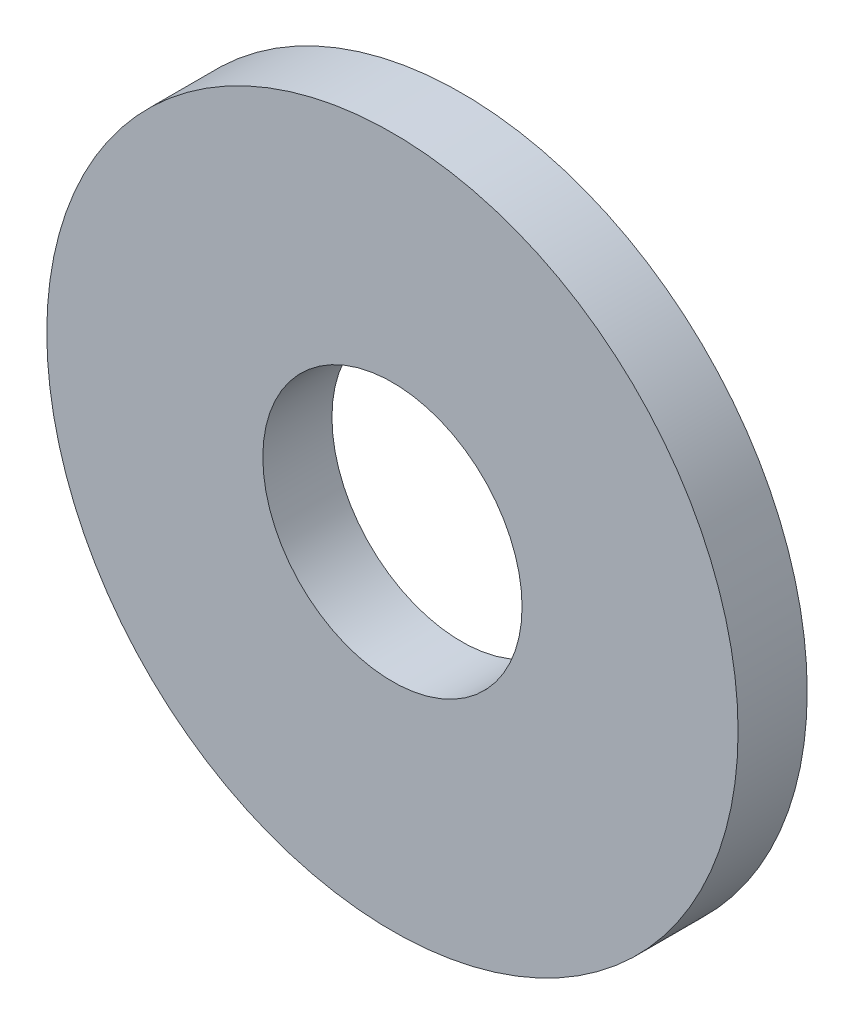
ISO-10303-21;
HEADER;
FILE_DESCRIPTION(('STEP AP214'),'2;1');
FILE_NAME('part.step','',(''),(''),'','','');
FILE_SCHEMA(('AUTOMOTIVE_DESIGN { 1 0 10303 214 1 1 1 1 }'));
ENDSEC;
DATA;
#1=APPLICATION_CONTEXT('core data for automotive mechanical design processes');
#2=APPLICATION_PROTOCOL_DEFINITION('international standard','automotive_design',2000,#1);
#3=PRODUCT_CONTEXT('',#1,'mechanical');
#4=PRODUCT('Part','Part','',(#3));
#5=PRODUCT_RELATED_PRODUCT_CATEGORY('part','',(#4));
#6=PRODUCT_DEFINITION_FORMATION('','',#4);
#7=PRODUCT_DEFINITION_CONTEXT('part definition',#1,'design');
#8=PRODUCT_DEFINITION('design','',#6,#7);
#9=PRODUCT_DEFINITION_SHAPE('','',#8);
#10=(LENGTH_UNIT() NAMED_UNIT(*) SI_UNIT(.MILLI.,.METRE.));
#11=(NAMED_UNIT(*) PLANE_ANGLE_UNIT() SI_UNIT($,.RADIAN.));
#12=(NAMED_UNIT(*) SI_UNIT($,.STERADIAN.) SOLID_ANGLE_UNIT());
#13=UNCERTAINTY_MEASURE_WITH_UNIT(LENGTH_MEASURE(1.E-05),#10,'distance_accuracy_value','');
#14=(GEOMETRIC_REPRESENTATION_CONTEXT(3) GLOBAL_UNCERTAINTY_ASSIGNED_CONTEXT((#13)) GLOBAL_UNIT_ASSIGNED_CONTEXT((#10,
#11,#12)) REPRESENTATION_CONTEXT('',''));
#15=CARTESIAN_POINT('',(0.,0.,0.));
#16=DIRECTION('',(0.,0.,1.));
#17=DIRECTION('',(1.,0.,0.));
#18=AXIS2_PLACEMENT_3D('',#15,#16,#17);
#19=CARTESIAN_POINT('',(0.,0.,0.8));
#20=DIRECTION('',(0.,0.,1.));
#21=DIRECTION('',(1.,0.,0.));
#22=AXIS2_PLACEMENT_3D('',#19,#20,#21);
#23=PLANE('',#22);
#24=CARTESIAN_POINT('',(0.,0.,0.8));
#25=DIRECTION('',(0.,0.,1.));
#26=DIRECTION('',(1.,0.,0.));
#27=AXIS2_PLACEMENT_3D('',#24,#25,#26);
#28=CIRCLE('',#27,4.);
#29=CARTESIAN_POINT('',(4.,0.,0.8));
#30=VERTEX_POINT('',#29);
#31=EDGE_CURVE('E10',#30,#30,#28,.T.);
#32=ORIENTED_EDGE('',*,*,#31,.T.);
#33=EDGE_LOOP('',(#32));
#34=FACE_BOUND('',#33,.T.);
#35=CARTESIAN_POINT('',(0.,0.,0.8));
#36=DIRECTION('',(0.,0.,1.));
#37=DIRECTION('',(1.,0.,0.));
#38=AXIS2_PLACEMENT_3D('',#35,#36,#37);
#39=CIRCLE('',#38,1.5);
#40=CARTESIAN_POINT('',(1.5,0.,0.8));
#41=VERTEX_POINT('',#40);
#42=EDGE_CURVE('E52',#41,#41,#39,.T.);
#43=ORIENTED_EDGE('',*,*,#42,.F.);
#44=EDGE_LOOP('',(#43));
#45=FACE_BOUND('',#44,.T.);
#46=ADVANCED_FACE('F41',(#34,#45),#23,.T.);
#47=CARTESIAN_POINT('',(0.,0.,0.));
#48=DIRECTION('',(0.,0.,1.));
#49=DIRECTION('',(1.,0.,0.));
#50=AXIS2_PLACEMENT_3D('',#47,#48,#49);
#51=PLANE('',#50);
#52=CARTESIAN_POINT('',(0.,0.,0.));
#53=DIRECTION('',(0.,0.,1.));
#54=DIRECTION('',(1.,0.,0.));
#55=AXIS2_PLACEMENT_3D('',#52,#53,#54);
#56=CIRCLE('',#55,4.);
#57=CARTESIAN_POINT('',(4.,0.,0.));
#58=VERTEX_POINT('',#57);
#59=EDGE_CURVE('E45',#58,#58,#56,.T.);
#60=ORIENTED_EDGE('',*,*,#59,.F.);
#61=EDGE_LOOP('',(#60));
#62=FACE_BOUND('',#61,.T.);
#63=CARTESIAN_POINT('',(0.,0.,0.));
#64=DIRECTION('',(0.,0.,1.));
#65=DIRECTION('',(1.,0.,0.));
#66=AXIS2_PLACEMENT_3D('',#63,#64,#65);
#67=CIRCLE('',#66,1.5);
#68=CARTESIAN_POINT('',(1.5,0.,0.));
#69=VERTEX_POINT('',#68);
#70=EDGE_CURVE('E54',#69,#69,#67,.T.);
#71=ORIENTED_EDGE('',*,*,#70,.T.);
#72=EDGE_LOOP('',(#71));
#73=FACE_BOUND('',#72,.T.);
#74=ADVANCED_FACE('F64',(#62,#73),#51,.F.);
#75=CARTESIAN_POINT('',(0.,0.,0.8));
#76=DIRECTION('',(0.,0.,-1.));
#77=DIRECTION('',(-1.,0.,0.));
#78=AXIS2_PLACEMENT_3D('',#75,#76,#77);
#79=CYLINDRICAL_SURFACE('',#78,4.);
#80=ORIENTED_EDGE('',*,*,#31,.F.);
#81=EDGE_LOOP('',(#80));
#82=FACE_BOUND('',#81,.T.);
#83=ORIENTED_EDGE('',*,*,#59,.T.);
#84=EDGE_LOOP('',(#83));
#85=FACE_BOUND('',#84,.T.);
#86=ADVANCED_FACE('F43',(#82,#85),#79,.T.);
#87=CARTESIAN_POINT('',(0.,0.,0.8));
#88=DIRECTION('',(0.,0.,-1.));
#89=DIRECTION('',(-1.,0.,0.));
#90=AXIS2_PLACEMENT_3D('',#87,#88,#89);
#91=CYLINDRICAL_SURFACE('',#90,1.5);
#92=ORIENTED_EDGE('',*,*,#42,.T.);
#93=EDGE_LOOP('',(#92));
#94=FACE_BOUND('',#93,.T.);
#95=ORIENTED_EDGE('',*,*,#70,.F.);
#96=EDGE_LOOP('',(#95));
#97=FACE_BOUND('',#96,.T.);
#98=ADVANCED_FACE('F60',(#94,#97),#91,.F.);
#99=CLOSED_SHELL('',(#46,#74,#86,#98));
#100=MANIFOLD_SOLID_BREP('B2',#99);
#101=ADVANCED_BREP_SHAPE_REPRESENTATION('',(#18,#100),#14);
#102=SHAPE_DEFINITION_REPRESENTATION(#9,#101);
ENDSEC;
END-ISO-10303-21;
